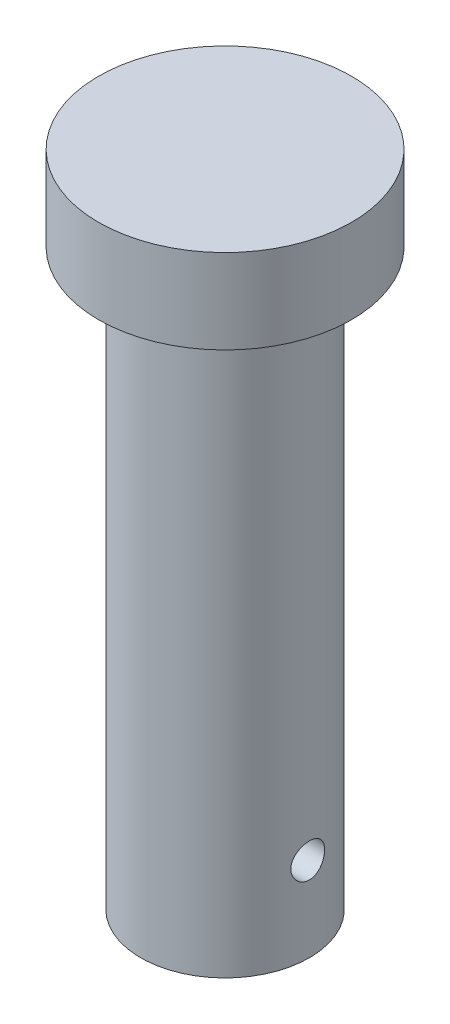
ISO-10303-21;
HEADER;
FILE_DESCRIPTION(('STEP AP214'),'2;1');
FILE_NAME('part.step','',(''),(''),'','','');
FILE_SCHEMA(('AUTOMOTIVE_DESIGN { 1 0 10303 214 1 1 1 1 }'));
ENDSEC;
DATA;
#1=APPLICATION_CONTEXT('core data for automotive mechanical design processes');
#2=APPLICATION_PROTOCOL_DEFINITION('international standard','automotive_design',2000,#1);
#3=PRODUCT_CONTEXT('',#1,'mechanical');
#4=PRODUCT('Part','Part','',(#3));
#5=PRODUCT_RELATED_PRODUCT_CATEGORY('part','',(#4));
#6=PRODUCT_DEFINITION_FORMATION('','',#4);
#7=PRODUCT_DEFINITION_CONTEXT('part definition',#1,'design');
#8=PRODUCT_DEFINITION('design','',#6,#7);
#9=PRODUCT_DEFINITION_SHAPE('','',#8);
#10=(LENGTH_UNIT() NAMED_UNIT(*) SI_UNIT(.MILLI.,.METRE.));
#11=(NAMED_UNIT(*) PLANE_ANGLE_UNIT() SI_UNIT($,.RADIAN.));
#12=(NAMED_UNIT(*) SI_UNIT($,.STERADIAN.) SOLID_ANGLE_UNIT());
#13=UNCERTAINTY_MEASURE_WITH_UNIT(LENGTH_MEASURE(1.E-05),#10,'distance_accuracy_value','');
#14=(GEOMETRIC_REPRESENTATION_CONTEXT(3) GLOBAL_UNCERTAINTY_ASSIGNED_CONTEXT((#13)) GLOBAL_UNIT_ASSIGNED_CONTEXT((#10,
#11,#12)) REPRESENTATION_CONTEXT('',''));
#15=CARTESIAN_POINT('',(0.,0.,0.));
#16=DIRECTION('',(0.,0.,1.));
#17=DIRECTION('',(1.,0.,0.));
#18=AXIS2_PLACEMENT_3D('',#15,#16,#17);
#19=CARTESIAN_POINT('',(0.,-15.,0.));
#20=DIRECTION('',(0.,1.,0.));
#21=DIRECTION('',(0.,0.,1.));
#22=AXIS2_PLACEMENT_3D('',#19,#20,#21);
#23=CYLINDRICAL_SURFACE('',#22,22.5);
#24=CARTESIAN_POINT('',(0.,-15.,0.));
#25=DIRECTION('',(0.,1.,0.));
#26=DIRECTION('',(0.,0.,1.));
#27=AXIS2_PLACEMENT_3D('',#24,#25,#26);
#28=CIRCLE('',#27,22.5);
#29=CARTESIAN_POINT('',(0.,-15.,22.5));
#30=VERTEX_POINT('',#29);
#31=EDGE_CURVE('E54',#30,#30,#28,.T.);
#32=ORIENTED_EDGE('',*,*,#31,.T.);
#33=EDGE_LOOP('',(#32));
#34=FACE_BOUND('',#33,.T.);
#35=CARTESIAN_POINT('',(0.,0.,0.));
#36=DIRECTION('',(0.,1.,0.));
#37=DIRECTION('',(0.,0.,1.));
#38=AXIS2_PLACEMENT_3D('',#35,#36,#37);
#39=CIRCLE('',#38,22.5);
#40=CARTESIAN_POINT('',(0.,0.,22.5));
#41=VERTEX_POINT('',#40);
#42=EDGE_CURVE('E60',#41,#41,#39,.T.);
#43=ORIENTED_EDGE('',*,*,#42,.F.);
#44=EDGE_LOOP('',(#43));
#45=FACE_BOUND('',#44,.T.);
#46=ADVANCED_FACE('F41',(#34,#45),#23,.T.);
#47=CARTESIAN_POINT('',(0.,-15.,0.));
#48=DIRECTION('',(0.,1.,0.));
#49=DIRECTION('',(0.,0.,1.));
#50=AXIS2_PLACEMENT_3D('',#47,#48,#49);
#51=PLANE('',#50);
#52=CARTESIAN_POINT('',(0.,-15.,0.));
#53=DIRECTION('',(0.,-1.,0.));
#54=DIRECTION('',(0.,0.,-1.));
#55=AXIS2_PLACEMENT_3D('',#52,#53,#54);
#56=CIRCLE('',#55,15.);
#57=CARTESIAN_POINT('',(0.,-15.,-15.));
#58=VERTEX_POINT('',#57);
#59=EDGE_CURVE('E10',#58,#58,#56,.T.);
#60=ORIENTED_EDGE('',*,*,#59,.F.);
#61=EDGE_LOOP('',(#60));
#62=FACE_BOUND('',#61,.T.);
#63=ORIENTED_EDGE('',*,*,#31,.F.);
#64=EDGE_LOOP('',(#63));
#65=FACE_BOUND('',#64,.T.);
#66=ADVANCED_FACE('F92',(#62,#65),#51,.F.);
#67=CARTESIAN_POINT('',(0.,0.,0.));
#68=DIRECTION('',(0.,1.,0.));
#69=DIRECTION('',(0.,0.,1.));
#70=AXIS2_PLACEMENT_3D('',#67,#68,#69);
#71=PLANE('',#70);
#72=ORIENTED_EDGE('',*,*,#42,.T.);
#73=EDGE_LOOP('',(#72));
#74=FACE_BOUND('',#73,.T.);
#75=ADVANCED_FACE('F88',(#74),#71,.T.);
#76=CARTESIAN_POINT('',(0.,-117.,0.));
#77=DIRECTION('',(0.,1.,0.));
#78=DIRECTION('',(0.,0.,1.));
#79=AXIS2_PLACEMENT_3D('',#76,#77,#78);
#80=CYLINDRICAL_SURFACE('',#79,15.);
#81=CARTESIAN_POINT('',(-14.6969384566991,-102.,-3.));
#82=CARTESIAN_POINT('',(-14.6969417707994,-101.833306873527,-2.99999383762582));
#83=CARTESIAN_POINT('',(-14.6998052480611,-101.66653613,-2.98605951515444));
#84=CARTESIAN_POINT('',(-14.7109329391462,-101.337712484571,-2.93073685074853));
#85=CARTESIAN_POINT('',(-14.7192014743436,-101.175663466092,-2.88932654121148));
#86=CARTESIAN_POINT('',(-14.7401662116556,-100.861088089937,-2.78038734785924));
#87=CARTESIAN_POINT('',(-14.7528580086323,-100.708552435402,-2.71288444245787));
#88=CARTESIAN_POINT('',(-14.7812339844198,-100.416975465909,-2.55374732301152));
#89=CARTESIAN_POINT('',(-14.7969179962038,-100.277933398386,-2.46211445580346));
#90=CARTESIAN_POINT('',(-14.8297589908276,-100.015316988438,-2.25593722696031));
#91=CARTESIAN_POINT('',(-14.8469321351174,-99.8919612363481,-2.14111696773996));
#92=CARTESIAN_POINT('',(-14.880674169078,-99.666127399263,-1.89242036706393));
#93=CARTESIAN_POINT('',(-14.8972430163249,-99.5636507777484,-1.75854269093395));
#94=CARTESIAN_POINT('',(-14.9280838925269,-99.3816359471146,-1.47408406777277));
#95=CARTESIAN_POINT('',(-14.9423346432465,-99.3023054585501,-1.32336770301663));
#96=CARTESIAN_POINT('',(-14.9667521065089,-99.1701751888556,-1.01041245116181));
#97=CARTESIAN_POINT('',(-14.9769192013236,-99.117372924297,-0.84817464426166));
#98=CARTESIAN_POINT('',(-14.9919096206526,-99.0404784191411,-0.519050319835486));
#99=CARTESIAN_POINT('',(-14.9968015886438,-99.016017067287,-0.352253217644446));
#100=CARTESIAN_POINT('',(-15.0009276355081,-98.9953471444851,-0.0168557053126142));
#101=CARTESIAN_POINT('',(-15.0001622595828,-98.9991358510625,0.151744529495524));
#102=CARTESIAN_POINT('',(-14.9931130460555,-99.0345785406467,0.48342600223076));
#103=CARTESIAN_POINT('',(-14.9869079509751,-99.0658349315035,0.646551642895404));
#104=CARTESIAN_POINT('',(-14.9697653147823,-99.1546950973767,0.965194879740897));
#105=CARTESIAN_POINT('',(-14.9588275843212,-99.2122999265756,1.12071217124138));
#106=CARTESIAN_POINT('',(-14.9333188805988,-99.3525901204418,1.42085838960266));
#107=CARTESIAN_POINT('',(-14.9187254452567,-99.4354312533146,1.56541252240169));
#108=CARTESIAN_POINT('',(-14.8875140842136,-99.6237272317098,1.83871513757926));
#109=CARTESIAN_POINT('',(-14.8708959256567,-99.7291846793115,1.96746179857499));
#110=CARTESIAN_POINT('',(-14.8371289309338,-99.9619008663254,2.20785429316037));
#111=CARTESIAN_POINT('',(-14.8199758937255,-100.089507560189,2.3191629497209));
#112=CARTESIAN_POINT('',(-14.7873471479628,-100.361749327352,2.51885547953042));
#113=CARTESIAN_POINT('',(-14.7718714711364,-100.50638472265,2.60723891918325));
#114=CARTESIAN_POINT('',(-14.7443414241877,-100.809062495465,2.75868844440564));
#115=CARTESIAN_POINT('',(-14.7322944469065,-100.967132902919,2.82169994333313));
#116=CARTESIAN_POINT('',(-14.7130942896382,-101.291913971172,2.92017102488275));
#117=CARTESIAN_POINT('',(-14.7059404718528,-101.458623502857,2.95563419836993));
#118=CARTESIAN_POINT('',(-14.6974643780348,-101.792894573997,2.99749801810816));
#119=CARTESIAN_POINT('',(-14.6960444117146,-101.960392722931,3.00438557669374));
#120=CARTESIAN_POINT('',(-14.6989345706656,-102.294144669599,2.99021288493222));
#121=CARTESIAN_POINT('',(-14.7032443710116,-102.460398537357,2.96915421936733));
#122=CARTESIAN_POINT('',(-14.7170169748474,-102.785305920877,2.90010662422247));
#123=CARTESIAN_POINT('',(-14.7264299704349,-102.944017029107,2.8523778625179));
#124=CARTESIAN_POINT('',(-14.7493046805499,-103.251189837086,2.73162310592555));
#125=CARTESIAN_POINT('',(-14.7627667285881,-103.399650691307,2.65859502711953));
#126=CARTESIAN_POINT('',(-14.7924421788612,-103.68423932985,2.4882124266468));
#127=CARTESIAN_POINT('',(-14.8086891559471,-103.820181138902,2.39055323394826));
#128=CARTESIAN_POINT('',(-14.8420117147991,-104.073924936003,2.17408671663814));
#129=CARTESIAN_POINT('',(-14.8590873817145,-104.191725054748,2.05527721543362));
#130=CARTESIAN_POINT('',(-14.8924603760765,-104.407687677557,1.79769682049368));
#131=CARTESIAN_POINT('',(-14.9087417312605,-104.50552096395,1.65864749678889));
#132=CARTESIAN_POINT('',(-14.9384138288586,-104.676437644499,1.36580368990427));
#133=CARTESIAN_POINT('',(-14.9518046926563,-104.749522078034,1.21200982630053));
#134=CARTESIAN_POINT('',(-14.974118821832,-104.86838661524,0.894908042472046));
#135=CARTESIAN_POINT('',(-14.9830673742781,-104.914321554679,0.731660020434242));
#136=CARTESIAN_POINT('',(-14.9955970781298,-104.978073742992,0.399568364039742));
#137=CARTESIAN_POINT('',(-14.9991788759955,-104.995894378427,0.230725406133642));
#138=CARTESIAN_POINT('',(-15.0005562136234,-105.002780942889,-0.104618681710856));
#139=CARTESIAN_POINT('',(-14.9984513564799,-104.992341841369,-0.271109436424475));
#140=CARTESIAN_POINT('',(-14.9889013068102,-104.944098148357,-0.599913093946944));
#141=CARTESIAN_POINT('',(-14.9814561814329,-104.906293900956,-0.762226049261162));
#142=CARTESIAN_POINT('',(-14.9620649509476,-104.804613023725,-1.07775824923519));
#143=CARTESIAN_POINT('',(-14.9501291174284,-104.740795865607,-1.23099732972048));
#144=CARTESIAN_POINT('',(-14.9230416637104,-104.588963276007,-1.5246636605582));
#145=CARTESIAN_POINT('',(-14.9078897894096,-104.500945932286,-1.66508989730353));
#146=CARTESIAN_POINT('',(-14.8757279747022,-104.301541838816,-1.93159167031774));
#147=CARTESIAN_POINT('',(-14.858692002537,-104.189800990849,-2.05739914834453));
#148=CARTESIAN_POINT('',(-14.8248366872359,-103.946849279704,-2.28864785327552));
#149=CARTESIAN_POINT('',(-14.8080173963616,-103.81563381156,-2.39408424962674));
#150=CARTESIAN_POINT('',(-14.7763002820179,-103.535762049929,-2.58267665834994));
#151=CARTESIAN_POINT('',(-14.7614251071368,-103.386933116636,-2.66558044385427));
#152=CARTESIAN_POINT('',(-14.7355571137924,-103.07720168022,-2.80507214779868));
#153=CARTESIAN_POINT('',(-14.7245607757495,-102.916310283938,-2.86168393792249));
#154=CARTESIAN_POINT('',(-14.7098904341353,-102.629212633671,-2.93600741957297));
#155=CARTESIAN_POINT('',(-14.7050635474382,-102.504643741458,-2.95996169557105));
#156=CARTESIAN_POINT('',(-14.6985863537725,-102.253398136347,-2.99196005387913));
#157=CARTESIAN_POINT('',(-14.6969359372925,-102.126721496267,-3.00000468468793));
#158=CARTESIAN_POINT('',(-14.6969384566991,-102.,-3.));
#159=B_SPLINE_CURVE_WITH_KNOTS('',3,(#81,#82,#83,#84,#85,#86,#87,#88,#89,#90,#91,#92,#93,#94,
#95,#96,#97,#98,#99,#100,#101,#102,#103,#104,#105,#106,#107,#108,#109,#110,#111,#112,#113,#114,
#115,#116,#117,#118,#119,#120,#121,#122,#123,#124,#125,#126,#127,#128,#129,#130,#131,#132,#133,
#134,#135,#136,#137,#138,#139,#140,#141,#142,#143,#144,#145,#146,#147,#148,#149,#150,#151,#152,
#153,#154,#155,#156,#157,#158),.UNSPECIFIED.,.T.,.F.,(4,2,2,2,2,2,2,2,2,2,2,2,2,2,2,2,2,2,2,2,2,
2,2,2,2,2,2,2,2,2,2,2,2,2,2,2,2,2,4),(0.,0.499615391608283,0.999630717852883,1.49914949382175,
1.99864039457959,2.50446757645311,3.01033020106266,3.52060201312351,4.03082604739679,
4.53432746649241,5.03778036348745,5.53406368900612,6.0303668722125,6.52979772666908,
7.02928607310198,7.5374804028745,8.04568434368161,8.55497589518331,9.06420105048074,
9.56471273413781,10.0651960358526,10.5608802534996,11.0566053106319,11.5587917932356,
12.0610299861063,12.5709780520035,13.0809046989031,13.5878944073595,14.0948230407488,
14.5929305224406,15.0910317410027,15.5880005122635,16.0850085640405,16.5900345607679,
17.0951801666934,17.6057669573882,18.115889252706,18.4957141091448,18.8755258705644),.UNSPECIFIED.);
#160=CARTESIAN_POINT('',(-14.6969384566991,-102.,-3.));
#161=VERTEX_POINT('',#160);
#162=EDGE_CURVE('E44',#161,#161,#159,.T.);
#163=ORIENTED_EDGE('',*,*,#162,.T.);
#164=EDGE_LOOP('',(#163));
#165=FACE_BOUND('',#164,.T.);
#166=CARTESIAN_POINT('',(14.6969384566991,-102.,-3.));
#167=CARTESIAN_POINT('',(14.6969417707994,-102.166693126473,-2.99999383762582));
#168=CARTESIAN_POINT('',(14.6998052480611,-102.33346387,-2.98605951515444));
#169=CARTESIAN_POINT('',(14.7109329391462,-102.662287515429,-2.93073685074853));
#170=CARTESIAN_POINT('',(14.7192014743436,-102.824336533908,-2.88932654121148));
#171=CARTESIAN_POINT('',(14.7401662116556,-103.138911910063,-2.78038734785924));
#172=CARTESIAN_POINT('',(14.7528580086323,-103.291447564598,-2.71288444245787));
#173=CARTESIAN_POINT('',(14.7812339844198,-103.583024534091,-2.55374732301152));
#174=CARTESIAN_POINT('',(14.7969179962038,-103.722066601614,-2.46211445580346));
#175=CARTESIAN_POINT('',(14.8297589908276,-103.984683011562,-2.25593722696031));
#176=CARTESIAN_POINT('',(14.8469321351174,-104.108038763652,-2.14111696773996));
#177=CARTESIAN_POINT('',(14.880674169078,-104.333872600737,-1.89242036706393));
#178=CARTESIAN_POINT('',(14.8972430163249,-104.436349222252,-1.75854269093395));
#179=CARTESIAN_POINT('',(14.9280838925269,-104.618364052885,-1.47408406777277));
#180=CARTESIAN_POINT('',(14.9423346432465,-104.69769454145,-1.32336770301663));
#181=CARTESIAN_POINT('',(14.9667521065089,-104.829824811144,-1.01041245116181));
#182=CARTESIAN_POINT('',(14.9769192013236,-104.882627075703,-0.84817464426166));
#183=CARTESIAN_POINT('',(14.9919096206526,-104.959521580859,-0.519050319835486));
#184=CARTESIAN_POINT('',(14.9968015886438,-104.983982932713,-0.352253217644447));
#185=CARTESIAN_POINT('',(15.0009276355081,-105.004652855515,-0.0168557053126142));
#186=CARTESIAN_POINT('',(15.0001622595828,-105.000864148937,0.151744529495524));
#187=CARTESIAN_POINT('',(14.9931130460555,-104.965421459353,0.48342600223076));
#188=CARTESIAN_POINT('',(14.9869079509751,-104.934165068496,0.646551642895403));
#189=CARTESIAN_POINT('',(14.9697653147823,-104.845304902623,0.965194879740897));
#190=CARTESIAN_POINT('',(14.9588275843212,-104.787700073424,1.12071217124138));
#191=CARTESIAN_POINT('',(14.9333188805988,-104.647409879558,1.42085838960266));
#192=CARTESIAN_POINT('',(14.9187254452567,-104.564568746685,1.5654125224017));
#193=CARTESIAN_POINT('',(14.8875140842136,-104.37627276829,1.83871513757926));
#194=CARTESIAN_POINT('',(14.8708959256567,-104.270815320688,1.96746179857499));
#195=CARTESIAN_POINT('',(14.8371289309338,-104.038099133675,2.20785429316037));
#196=CARTESIAN_POINT('',(14.8199758937255,-103.910492439811,2.3191629497209));
#197=CARTESIAN_POINT('',(14.7873471479628,-103.638250672648,2.51885547953042));
#198=CARTESIAN_POINT('',(14.7718714711364,-103.49361527735,2.60723891918325));
#199=CARTESIAN_POINT('',(14.7443414241877,-103.190937504535,2.75868844440564));
#200=CARTESIAN_POINT('',(14.7322944469065,-103.032867097081,2.82169994333313));
#201=CARTESIAN_POINT('',(14.7130942896382,-102.708086028828,2.92017102488275));
#202=CARTESIAN_POINT('',(14.7059404718528,-102.541376497143,2.95563419836993));
#203=CARTESIAN_POINT('',(14.6974643780348,-102.207105426003,2.99749801810816));
#204=CARTESIAN_POINT('',(14.6960444117146,-102.039607277069,3.00438557669374));
#205=CARTESIAN_POINT('',(14.6989345706656,-101.705855330401,2.99021288493222));
#206=CARTESIAN_POINT('',(14.7032443710116,-101.539601462643,2.96915421936733));
#207=CARTESIAN_POINT('',(14.7170169748474,-101.214694079123,2.90010662422247));
#208=CARTESIAN_POINT('',(14.7264299704349,-101.055982970893,2.8523778625179));
#209=CARTESIAN_POINT('',(14.7493046805499,-100.748810162914,2.73162310592556));
#210=CARTESIAN_POINT('',(14.7627667285881,-100.600349308693,2.65859502711954));
#211=CARTESIAN_POINT('',(14.7924421788612,-100.31576067015,2.4882124266468));
#212=CARTESIAN_POINT('',(14.8086891559471,-100.179818861098,2.39055323394827));
#213=CARTESIAN_POINT('',(14.8420117147991,-99.9260750639973,2.17408671663814));
#214=CARTESIAN_POINT('',(14.8590873817145,-99.8082749452522,2.05527721543362));
#215=CARTESIAN_POINT('',(14.8924603760765,-99.5923123224433,1.79769682049368));
#216=CARTESIAN_POINT('',(14.9087417312605,-99.49447903605,1.65864749678889));
#217=CARTESIAN_POINT('',(14.9384138288586,-99.3235623555012,1.36580368990427));
#218=CARTESIAN_POINT('',(14.9518046926563,-99.2504779219656,1.21200982630053));
#219=CARTESIAN_POINT('',(14.974118821832,-99.1316133847601,0.894908042472046));
#220=CARTESIAN_POINT('',(14.9830673742781,-99.0856784453212,0.731660020434242));
#221=CARTESIAN_POINT('',(14.9955970781298,-99.0219262570085,0.399568364039742));
#222=CARTESIAN_POINT('',(14.9991788759955,-99.004105621573,0.230725406133642));
#223=CARTESIAN_POINT('',(15.0005562136234,-98.9972190571113,-0.104618681710856));
#224=CARTESIAN_POINT('',(14.9984513564799,-99.0076581586313,-0.271109436424475));
#225=CARTESIAN_POINT('',(14.9889013068102,-99.0559018516435,-0.599913093946944));
#226=CARTESIAN_POINT('',(14.9814561814329,-99.0937060990444,-0.762226049261162));
#227=CARTESIAN_POINT('',(14.9620649509476,-99.1953869762747,-1.07775824923519));
#228=CARTESIAN_POINT('',(14.9501291174284,-99.2592041343929,-1.23099732972049));
#229=CARTESIAN_POINT('',(14.9230416637104,-99.4110367239933,-1.5246636605582));
#230=CARTESIAN_POINT('',(14.9078897894096,-99.4990540677135,-1.66508989730353));
#231=CARTESIAN_POINT('',(14.8757279747022,-99.6984581611839,-1.93159167031774));
#232=CARTESIAN_POINT('',(14.858692002537,-99.8101990091513,-2.05739914834452));
#233=CARTESIAN_POINT('',(14.8248366872359,-100.053150720296,-2.28864785327552));
#234=CARTESIAN_POINT('',(14.8080173963616,-100.18436618844,-2.39408424962674));
#235=CARTESIAN_POINT('',(14.7763002820179,-100.464237950071,-2.58267665834994));
#236=CARTESIAN_POINT('',(14.7614251071368,-100.613066883364,-2.66558044385427));
#237=CARTESIAN_POINT('',(14.7355571137924,-100.92279831978,-2.80507214779868));
#238=CARTESIAN_POINT('',(14.7245607757495,-101.083689716062,-2.86168393792249));
#239=CARTESIAN_POINT('',(14.7098904341353,-101.370787366329,-2.93600741957297));
#240=CARTESIAN_POINT('',(14.7050635474382,-101.495356258542,-2.95996169557105));
#241=CARTESIAN_POINT('',(14.6985863537725,-101.746601863653,-2.99196005387913));
#242=CARTESIAN_POINT('',(14.6969359372925,-101.873278503733,-3.00000468468793));
#243=CARTESIAN_POINT('',(14.6969384566991,-102.,-3.));
#244=B_SPLINE_CURVE_WITH_KNOTS('',3,(#166,#167,#168,#169,#170,#171,#172,#173,#174,#175,#176,
#177,#178,#179,#180,#181,#182,#183,#184,#185,#186,#187,#188,#189,#190,#191,#192,#193,#194,#195,
#196,#197,#198,#199,#200,#201,#202,#203,#204,#205,#206,#207,#208,#209,#210,#211,#212,#213,#214,
#215,#216,#217,#218,#219,#220,#221,#222,#223,#224,#225,#226,#227,#228,#229,#230,#231,#232,#233,
#234,#235,#236,#237,#238,#239,#240,#241,#242,#243),.UNSPECIFIED.,.T.,.F.,(4,2,2,2,2,2,2,2,2,2,2,
2,2,2,2,2,2,2,2,2,2,2,2,2,2,2,2,2,2,2,2,2,2,2,2,2,2,2,4),(0.,0.499615391608283,
0.999630717852883,1.49914949382175,1.99864039457959,2.50446757645311,3.01033020106266,
3.52060201312351,4.03082604739679,4.53432746649241,5.03778036348745,5.53406368900612,
6.0303668722125,6.5297977266691,7.02928607310198,7.5374804028745,8.04568434368161,
8.55497589518331,9.06420105048074,9.56471273413781,10.0651960358526,10.5608802534996,
11.0566053106319,11.5587917932356,12.0610299861063,12.5709780520035,13.0809046989031,
13.5878944073595,14.0948230407488,14.5929305224406,15.0910317410027,15.5880005122636,
16.0850085640405,16.5900345607679,17.0951801666934,17.6057669573882,18.1158892527059,
18.4957141091448,18.8755258705644),.UNSPECIFIED.);
#245=CARTESIAN_POINT('',(14.6969384566991,-102.,-3.));
#246=VERTEX_POINT('',#245);
#247=EDGE_CURVE('E67',#246,#246,#244,.T.);
#248=ORIENTED_EDGE('',*,*,#247,.T.);
#249=EDGE_LOOP('',(#248));
#250=FACE_BOUND('',#249,.T.);
#251=CARTESIAN_POINT('',(0.,-117.,0.));
#252=DIRECTION('',(0.,-1.,0.));
#253=DIRECTION('',(0.,0.,-1.));
#254=AXIS2_PLACEMENT_3D('',#251,#252,#253);
#255=CIRCLE('',#254,15.);
#256=CARTESIAN_POINT('',(0.,-117.,-15.));
#257=VERTEX_POINT('',#256);
#258=EDGE_CURVE('E63',#257,#257,#255,.T.);
#259=ORIENTED_EDGE('',*,*,#258,.F.);
#260=EDGE_LOOP('',(#259));
#261=FACE_BOUND('',#260,.T.);
#262=ORIENTED_EDGE('',*,*,#59,.T.);
#263=EDGE_LOOP('',(#262));
#264=FACE_BOUND('',#263,.T.);
#265=ADVANCED_FACE('F73',(#165,#250,#261,#264),#80,.T.);
#266=CARTESIAN_POINT('',(0.,-117.,0.));
#267=DIRECTION('',(0.,-1.,0.));
#268=DIRECTION('',(0.,0.,-1.));
#269=AXIS2_PLACEMENT_3D('',#266,#267,#268);
#270=PLANE('',#269);
#271=ORIENTED_EDGE('',*,*,#258,.T.);
#272=EDGE_LOOP('',(#271));
#273=FACE_BOUND('',#272,.T.);
#274=ADVANCED_FACE('F80',(#273),#270,.T.);
#275=CARTESIAN_POINT('',(-31.,-102.,0.));
#276=DIRECTION('',(1.,0.,0.));
#277=DIRECTION('',(0.,0.,-1.));
#278=AXIS2_PLACEMENT_3D('',#275,#276,#277);
#279=CYLINDRICAL_SURFACE('',#278,3.);
#280=ORIENTED_EDGE('',*,*,#247,.F.);
#281=EDGE_LOOP('',(#280));
#282=FACE_BOUND('',#281,.T.);
#283=ORIENTED_EDGE('',*,*,#162,.F.);
#284=EDGE_LOOP('',(#283));
#285=FACE_BOUND('',#284,.T.);
#286=ADVANCED_FACE('F77',(#282,#285),#279,.F.);
#287=CLOSED_SHELL('',(#46,#66,#75,#265,#274,#286));
#288=MANIFOLD_SOLID_BREP('B2',#287);
#289=ADVANCED_BREP_SHAPE_REPRESENTATION('',(#18,#288),#14);
#290=SHAPE_DEFINITION_REPRESENTATION(#9,#289);
ENDSEC;
END-ISO-10303-21;
